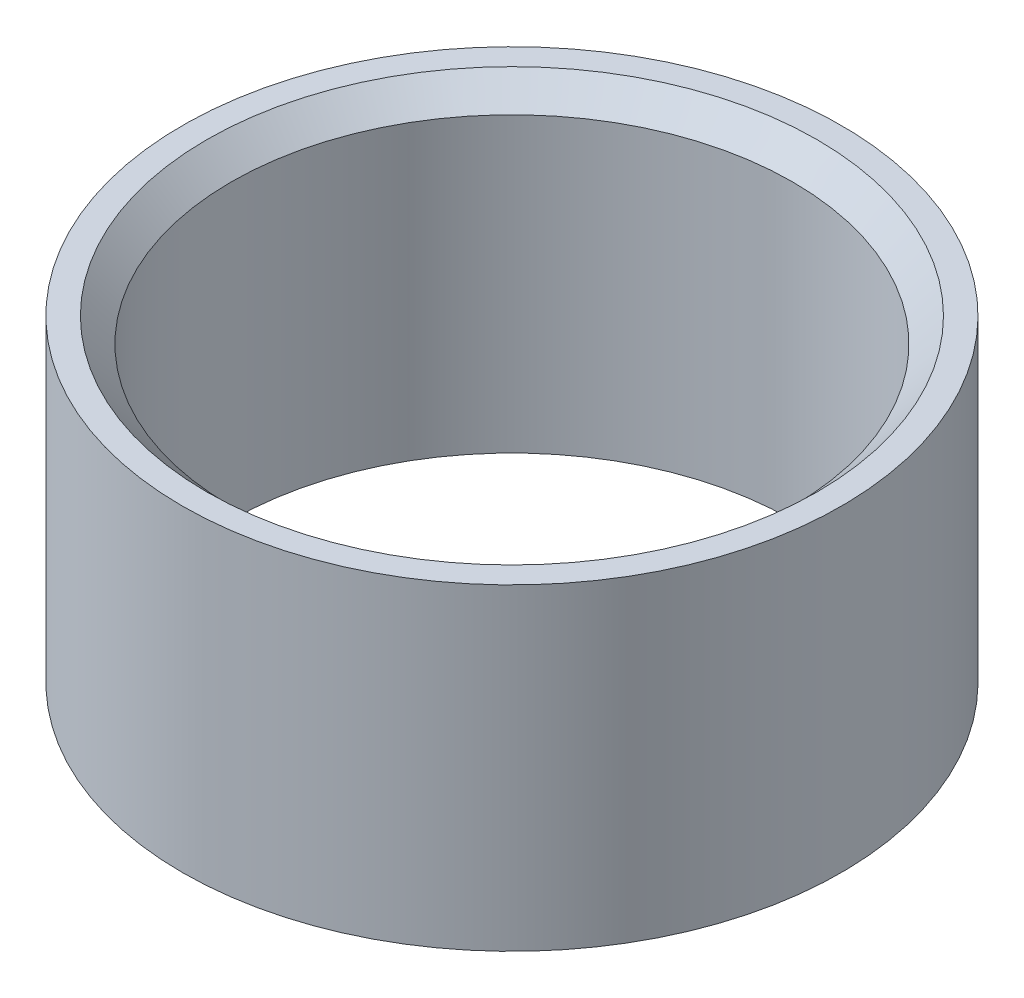
ISO-10303-21;
HEADER;
FILE_DESCRIPTION(('STEP AP214'),'2;1');
FILE_NAME('part.step','',(''),(''),'','','');
FILE_SCHEMA(('AUTOMOTIVE_DESIGN { 1 0 10303 214 1 1 1 1 }'));
ENDSEC;
DATA;
#1=APPLICATION_CONTEXT('core data for automotive mechanical design processes');
#2=APPLICATION_PROTOCOL_DEFINITION('international standard','automotive_design',2000,#1);
#3=PRODUCT_CONTEXT('',#1,'mechanical');
#4=PRODUCT('Part','Part','',(#3));
#5=PRODUCT_RELATED_PRODUCT_CATEGORY('part','',(#4));
#6=PRODUCT_DEFINITION_FORMATION('','',#4);
#7=PRODUCT_DEFINITION_CONTEXT('part definition',#1,'design');
#8=PRODUCT_DEFINITION('design','',#6,#7);
#9=PRODUCT_DEFINITION_SHAPE('','',#8);
#10=(LENGTH_UNIT() NAMED_UNIT(*) SI_UNIT(.MILLI.,.METRE.));
#11=(NAMED_UNIT(*) PLANE_ANGLE_UNIT() SI_UNIT($,.RADIAN.));
#12=(NAMED_UNIT(*) SI_UNIT($,.STERADIAN.) SOLID_ANGLE_UNIT());
#13=UNCERTAINTY_MEASURE_WITH_UNIT(LENGTH_MEASURE(1.E-05),#10,'distance_accuracy_value','');
#14=(GEOMETRIC_REPRESENTATION_CONTEXT(3) GLOBAL_UNCERTAINTY_ASSIGNED_CONTEXT((#13)) GLOBAL_UNIT_ASSIGNED_CONTEXT((#10,
#11,#12)) REPRESENTATION_CONTEXT('',''));
#15=CARTESIAN_POINT('',(0.,0.,0.));
#16=DIRECTION('',(0.,0.,1.));
#17=DIRECTION('',(1.,0.,0.));
#18=AXIS2_PLACEMENT_3D('',#15,#16,#17);
#19=CARTESIAN_POINT('',(0.,1.3,0.));
#20=DIRECTION('',(0.,-1.,0.));
#21=DIRECTION('',(0.,0.,-1.));
#22=AXIS2_PLACEMENT_3D('',#19,#20,#21);
#23=CYLINDRICAL_SURFACE('',#22,1.35);
#24=CARTESIAN_POINT('',(0.,1.3,0.));
#25=DIRECTION('',(0.,1.,0.));
#26=DIRECTION('',(0.,0.,1.));
#27=AXIS2_PLACEMENT_3D('',#24,#25,#26);
#28=CIRCLE('',#27,1.35);
#29=CARTESIAN_POINT('',(0.,1.3,1.35));
#30=VERTEX_POINT('',#29);
#31=EDGE_CURVE('E10',#30,#30,#28,.T.);
#32=ORIENTED_EDGE('',*,*,#31,.F.);
#33=EDGE_LOOP('',(#32));
#34=FACE_BOUND('',#33,.T.);
#35=CARTESIAN_POINT('',(0.,0.,0.));
#36=DIRECTION('',(0.,1.,0.));
#37=DIRECTION('',(0.,0.,1.));
#38=AXIS2_PLACEMENT_3D('',#35,#36,#37);
#39=CIRCLE('',#38,1.35);
#40=CARTESIAN_POINT('',(0.,0.,1.35));
#41=VERTEX_POINT('',#40);
#42=EDGE_CURVE('E35',#41,#41,#39,.T.);
#43=ORIENTED_EDGE('',*,*,#42,.T.);
#44=EDGE_LOOP('',(#43));
#45=FACE_BOUND('',#44,.T.);
#46=ADVANCED_FACE('F32',(#34,#45),#23,.T.);
#47=CARTESIAN_POINT('',(0.,1.3,0.));
#48=DIRECTION('',(0.,1.,0.));
#49=DIRECTION('',(0.,0.,1.));
#50=AXIS2_PLACEMENT_3D('',#47,#48,#49);
#51=PLANE('',#50);
#52=CARTESIAN_POINT('',(0.,1.3,0.));
#53=DIRECTION('',(0.,1.,0.));
#54=DIRECTION('',(0.,0.,1.));
#55=AXIS2_PLACEMENT_3D('',#52,#53,#54);
#56=CIRCLE('',#55,1.25);
#57=CARTESIAN_POINT('',(0.,1.3,1.25));
#58=VERTEX_POINT('',#57);
#59=EDGE_CURVE('E49',#58,#58,#56,.T.);
#60=ORIENTED_EDGE('',*,*,#59,.F.);
#61=EDGE_LOOP('',(#60));
#62=FACE_BOUND('',#61,.T.);
#63=ORIENTED_EDGE('',*,*,#31,.T.);
#64=EDGE_LOOP('',(#63));
#65=FACE_BOUND('',#64,.T.);
#66=ADVANCED_FACE('F55',(#62,#65),#51,.T.);
#67=CARTESIAN_POINT('',(0.,0.,0.));
#68=DIRECTION('',(0.,1.,0.));
#69=DIRECTION('',(0.,0.,1.));
#70=AXIS2_PLACEMENT_3D('',#67,#68,#69);
#71=PLANE('',#70);
#72=CARTESIAN_POINT('',(0.,0.,0.));
#73=DIRECTION('',(0.,1.,0.));
#74=DIRECTION('',(0.,0.,1.));
#75=AXIS2_PLACEMENT_3D('',#72,#73,#74);
#76=CIRCLE('',#75,1.15);
#77=CARTESIAN_POINT('',(0.,0.,1.15));
#78=VERTEX_POINT('',#77);
#79=EDGE_CURVE('E42',#78,#78,#76,.T.);
#80=ORIENTED_EDGE('',*,*,#79,.T.);
#81=EDGE_LOOP('',(#80));
#82=FACE_BOUND('',#81,.T.);
#83=ORIENTED_EDGE('',*,*,#42,.F.);
#84=EDGE_LOOP('',(#83));
#85=FACE_BOUND('',#84,.T.);
#86=ADVANCED_FACE('F57',(#82,#85),#71,.F.);
#87=CARTESIAN_POINT('',(0.,1.3,0.));
#88=DIRECTION('',(0.,1.,0.));
#89=DIRECTION('',(0.,0.,1.));
#90=AXIS2_PLACEMENT_3D('',#87,#88,#89);
#91=CYLINDRICAL_SURFACE('',#90,1.15);
#92=ORIENTED_EDGE('',*,*,#79,.F.);
#93=EDGE_LOOP('',(#92));
#94=FACE_BOUND('',#93,.T.);
#95=CARTESIAN_POINT('',(0.,1.2,0.));
#96=DIRECTION('',(0.,1.,0.));
#97=DIRECTION('',(0.,0.,1.));
#98=AXIS2_PLACEMENT_3D('',#95,#96,#97);
#99=CIRCLE('',#98,1.15);
#100=CARTESIAN_POINT('',(0.,1.2,1.15));
#101=VERTEX_POINT('',#100);
#102=EDGE_CURVE('E46',#101,#101,#99,.T.);
#103=ORIENTED_EDGE('',*,*,#102,.T.);
#104=EDGE_LOOP('',(#103));
#105=FACE_BOUND('',#104,.T.);
#106=ADVANCED_FACE('F63',(#94,#105),#91,.F.);
#107=CARTESIAN_POINT('',(0.,1.3,0.));
#108=DIRECTION('',(0.,1.,0.));
#109=DIRECTION('',(0.,0.,1.));
#110=AXIS2_PLACEMENT_3D('',#107,#108,#109);
#111=CONICAL_SURFACE('',#110,1.25,0.785398163397452);
#112=ORIENTED_EDGE('',*,*,#102,.F.);
#113=EDGE_LOOP('',(#112));
#114=FACE_BOUND('',#113,.T.);
#115=ORIENTED_EDGE('',*,*,#59,.T.);
#116=EDGE_LOOP('',(#115));
#117=FACE_BOUND('',#116,.T.);
#118=ADVANCED_FACE('F53',(#114,#117),#111,.F.);
#119=CLOSED_SHELL('',(#46,#66,#86,#106,#118));
#120=MANIFOLD_SOLID_BREP('B2',#119);
#121=ADVANCED_BREP_SHAPE_REPRESENTATION('',(#18,#120),#14);
#122=SHAPE_DEFINITION_REPRESENTATION(#9,#121);
ENDSEC;
END-ISO-10303-21;
